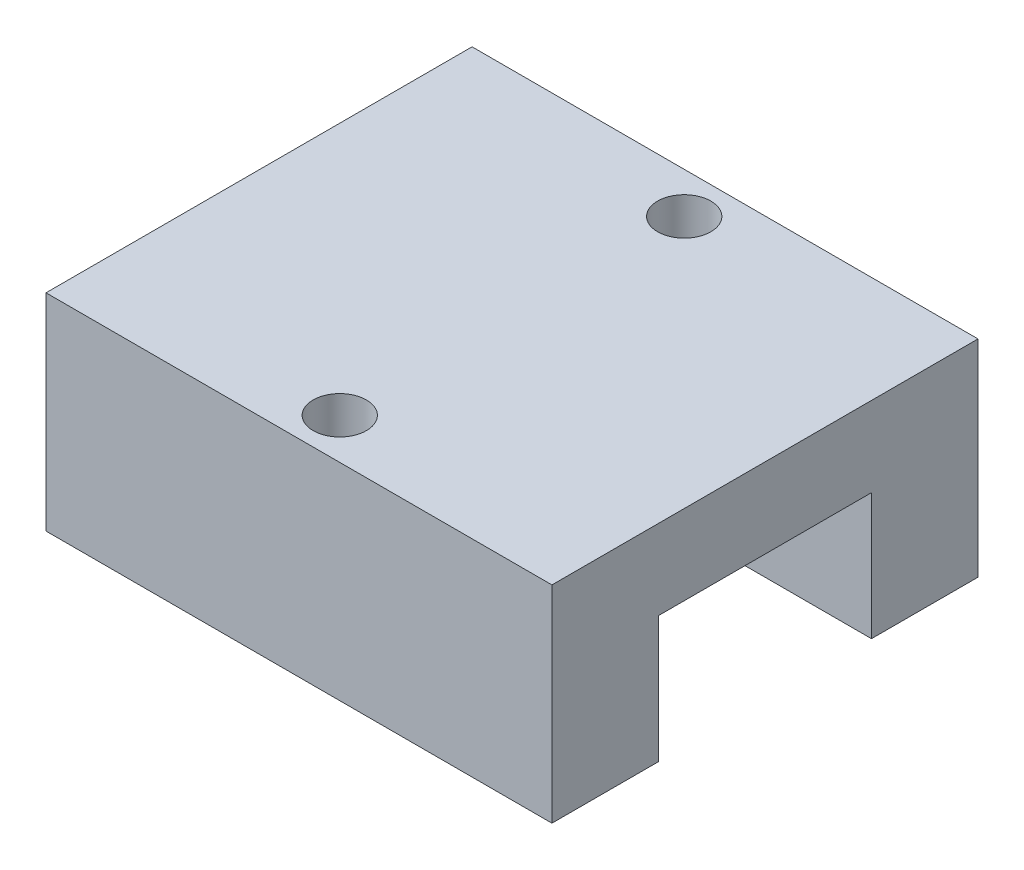
ISO-10303-21;
HEADER;
FILE_DESCRIPTION(('STEP AP214'),'2;1');
FILE_NAME('part.step','',(''),(''),'','','');
FILE_SCHEMA(('AUTOMOTIVE_DESIGN { 1 0 10303 214 1 1 1 1 }'));
ENDSEC;
DATA;
#1=APPLICATION_CONTEXT('core data for automotive mechanical design processes');
#2=APPLICATION_PROTOCOL_DEFINITION('international standard','automotive_design',2000,#1);
#3=PRODUCT_CONTEXT('',#1,'mechanical');
#4=PRODUCT('Part','Part','',(#3));
#5=PRODUCT_RELATED_PRODUCT_CATEGORY('part','',(#4));
#6=PRODUCT_DEFINITION_FORMATION('','',#4);
#7=PRODUCT_DEFINITION_CONTEXT('part definition',#1,'design');
#8=PRODUCT_DEFINITION('design','',#6,#7);
#9=PRODUCT_DEFINITION_SHAPE('','',#8);
#10=(LENGTH_UNIT() NAMED_UNIT(*) SI_UNIT(.MILLI.,.METRE.));
#11=(NAMED_UNIT(*) PLANE_ANGLE_UNIT() SI_UNIT($,.RADIAN.));
#12=(NAMED_UNIT(*) SI_UNIT($,.STERADIAN.) SOLID_ANGLE_UNIT());
#13=UNCERTAINTY_MEASURE_WITH_UNIT(LENGTH_MEASURE(1.E-05),#10,'distance_accuracy_value','');
#14=(GEOMETRIC_REPRESENTATION_CONTEXT(3) GLOBAL_UNCERTAINTY_ASSIGNED_CONTEXT((#13)) GLOBAL_UNIT_ASSIGNED_CONTEXT((#10,
#11,#12)) REPRESENTATION_CONTEXT('',''));
#15=CARTESIAN_POINT('',(0.,0.,0.));
#16=DIRECTION('',(0.,0.,1.));
#17=DIRECTION('',(1.,0.,0.));
#18=AXIS2_PLACEMENT_3D('',#15,#16,#17);
#19=CARTESIAN_POINT('',(-9.5,0.,8.));
#20=DIRECTION('',(0.,1.,0.));
#21=DIRECTION('',(0.,0.,1.));
#22=AXIS2_PLACEMENT_3D('',#19,#20,#21);
#23=PLANE('',#22);
#24=CARTESIAN_POINT('',(0.,0.,6.4675));
#25=DIRECTION('',(0.,-1.,0.));
#26=DIRECTION('',(0.,0.,-1.));
#27=AXIS2_PLACEMENT_3D('',#24,#25,#26);
#28=CIRCLE('',#27,1.);
#29=CARTESIAN_POINT('',(0.,0.,5.4675));
#30=VERTEX_POINT('',#29);
#31=EDGE_CURVE('E167',#30,#30,#28,.T.);
#32=ORIENTED_EDGE('',*,*,#31,.F.);
#33=EDGE_LOOP('',(#32));
#34=FACE_BOUND('',#33,.T.);
#35=DIRECTION('',(0.,0.,1.));
#36=VECTOR('',#35,1.);
#37=CARTESIAN_POINT('',(-9.49999999999999,0.,-8.));
#38=LINE('',#37,#36);
#39=CARTESIAN_POINT('',(-9.5,0.,4.));
#40=VERTEX_POINT('',#39);
#41=CARTESIAN_POINT('',(-9.5,0.,8.));
#42=VERTEX_POINT('',#41);
#43=EDGE_CURVE('E122',#40,#42,#38,.T.);
#44=ORIENTED_EDGE('',*,*,#43,.F.);
#45=DIRECTION('',(1.,0.,0.));
#46=VECTOR('',#45,1.);
#47=CARTESIAN_POINT('',(-9.5,0.,4.));
#48=LINE('',#47,#46);
#49=CARTESIAN_POINT('',(9.50000000000001,0.,4.));
#50=VERTEX_POINT('',#49);
#51=EDGE_CURVE('E11',#40,#50,#48,.T.);
#52=ORIENTED_EDGE('',*,*,#51,.T.);
#53=DIRECTION('',(0.,0.,-1.));
#54=VECTOR('',#53,1.);
#55=CARTESIAN_POINT('',(9.50000000000001,0.,-8.));
#56=LINE('',#55,#54);
#57=CARTESIAN_POINT('',(9.50000000000001,0.,8.));
#58=VERTEX_POINT('',#57);
#59=EDGE_CURVE('E121',#58,#50,#56,.T.);
#60=ORIENTED_EDGE('',*,*,#59,.F.);
#61=DIRECTION('',(1.,0.,0.));
#62=VECTOR('',#61,1.);
#63=CARTESIAN_POINT('',(-9.5,0.,8.));
#64=LINE('',#63,#62);
#65=EDGE_CURVE('E131',#42,#58,#64,.T.);
#66=ORIENTED_EDGE('',*,*,#65,.F.);
#67=EDGE_LOOP('',(#44,#52,#60,#66));
#68=FACE_BOUND('',#67,.T.);
#69=ADVANCED_FACE('F31',(#34,#68),#23,.F.);
#70=CARTESIAN_POINT('',(-9.49999999999999,7.75,-8.));
#71=DIRECTION('',(1.,0.,0.));
#72=DIRECTION('',(0.,0.,-1.));
#73=AXIS2_PLACEMENT_3D('',#70,#71,#72);
#74=PLANE('',#73);
#75=DIRECTION('',(0.,0.,1.));
#76=VECTOR('',#75,1.);
#77=CARTESIAN_POINT('',(-9.49999999999999,4.75,-8.));
#78=LINE('',#77,#76);
#79=CARTESIAN_POINT('',(-9.5,4.75,-4.));
#80=VERTEX_POINT('',#79);
#81=CARTESIAN_POINT('',(-9.5,4.75,4.));
#82=VERTEX_POINT('',#81);
#83=EDGE_CURVE('E170',#80,#82,#78,.T.);
#84=ORIENTED_EDGE('',*,*,#83,.T.);
#85=DIRECTION('',(0.,-1.,0.));
#86=VECTOR('',#85,1.);
#87=CARTESIAN_POINT('',(-9.5,7.75,4.));
#88=LINE('',#87,#86);
#89=EDGE_CURVE('E172',#82,#40,#88,.T.);
#90=ORIENTED_EDGE('',*,*,#89,.T.);
#91=ORIENTED_EDGE('',*,*,#43,.T.);
#92=DIRECTION('',(0.,-1.,0.));
#93=VECTOR('',#92,1.);
#94=CARTESIAN_POINT('',(-9.5,7.75,8.));
#95=LINE('',#94,#93);
#96=CARTESIAN_POINT('',(-9.5,7.75,8.));
#97=VERTEX_POINT('',#96);
#98=EDGE_CURVE('E140',#97,#42,#95,.T.);
#99=ORIENTED_EDGE('',*,*,#98,.F.);
#100=DIRECTION('',(0.,0.,1.));
#101=VECTOR('',#100,1.);
#102=CARTESIAN_POINT('',(-9.49999999999999,7.75,-8.));
#103=LINE('',#102,#101);
#104=CARTESIAN_POINT('',(-9.49999999999999,7.75,-8.));
#105=VERTEX_POINT('',#104);
#106=EDGE_CURVE('E129',#105,#97,#103,.T.);
#107=ORIENTED_EDGE('',*,*,#106,.F.);
#108=DIRECTION('',(0.,-1.,0.));
#109=VECTOR('',#108,1.);
#110=CARTESIAN_POINT('',(-9.49999999999999,7.75,-8.));
#111=LINE('',#110,#109);
#112=CARTESIAN_POINT('',(-9.49999999999999,0.,-8.));
#113=VERTEX_POINT('',#112);
#114=EDGE_CURVE('E135',#105,#113,#111,.T.);
#115=ORIENTED_EDGE('',*,*,#114,.T.);
#116=CARTESIAN_POINT('',(-9.5,0.,-4.));
#117=VERTEX_POINT('',#116);
#118=EDGE_CURVE('E146',#113,#117,#38,.T.);
#119=ORIENTED_EDGE('',*,*,#118,.T.);
#120=DIRECTION('',(0.,1.,0.));
#121=VECTOR('',#120,1.);
#122=CARTESIAN_POINT('',(-9.5,7.75,-4.));
#123=LINE('',#122,#121);
#124=EDGE_CURVE('E46',#117,#80,#123,.T.);
#125=ORIENTED_EDGE('',*,*,#124,.T.);
#126=EDGE_LOOP('',(#84,#90,#91,#99,#107,#115,#119,#125));
#127=FACE_BOUND('',#126,.T.);
#128=ADVANCED_FACE('F33',(#127),#74,.F.);
#129=CARTESIAN_POINT('',(-9.5,7.75,8.));
#130=DIRECTION('',(0.,0.,-1.));
#131=DIRECTION('',(-1.,0.,0.));
#132=AXIS2_PLACEMENT_3D('',#129,#130,#131);
#133=PLANE('',#132);
#134=ORIENTED_EDGE('',*,*,#65,.T.);
#135=DIRECTION('',(0.,-1.,0.));
#136=VECTOR('',#135,1.);
#137=CARTESIAN_POINT('',(9.50000000000001,7.75,8.));
#138=LINE('',#137,#136);
#139=CARTESIAN_POINT('',(9.50000000000001,7.75,8.));
#140=VERTEX_POINT('',#139);
#141=EDGE_CURVE('E126',#140,#58,#138,.T.);
#142=ORIENTED_EDGE('',*,*,#141,.F.);
#143=DIRECTION('',(1.,0.,0.));
#144=VECTOR('',#143,1.);
#145=CARTESIAN_POINT('',(-9.5,7.75,8.));
#146=LINE('',#145,#144);
#147=EDGE_CURVE('E84',#97,#140,#146,.T.);
#148=ORIENTED_EDGE('',*,*,#147,.F.);
#149=ORIENTED_EDGE('',*,*,#98,.T.);
#150=EDGE_LOOP('',(#134,#142,#148,#149));
#151=FACE_BOUND('',#150,.T.);
#152=ADVANCED_FACE('F184',(#151),#133,.F.);
#153=CARTESIAN_POINT('',(9.50000000000001,7.75,-8.));
#154=DIRECTION('',(-1.,0.,0.));
#155=DIRECTION('',(0.,0.,1.));
#156=AXIS2_PLACEMENT_3D('',#153,#154,#155);
#157=PLANE('',#156);
#158=ORIENTED_EDGE('',*,*,#59,.T.);
#159=DIRECTION('',(0.,-1.,0.));
#160=VECTOR('',#159,1.);
#161=CARTESIAN_POINT('',(9.50000000000001,0.,4.));
#162=LINE('',#161,#160);
#163=CARTESIAN_POINT('',(9.50000000000001,4.75,4.));
#164=VERTEX_POINT('',#163);
#165=EDGE_CURVE('E106',#164,#50,#162,.T.);
#166=ORIENTED_EDGE('',*,*,#165,.F.);
#167=DIRECTION('',(0.,0.,1.));
#168=VECTOR('',#167,1.);
#169=CARTESIAN_POINT('',(9.50000000000001,4.75,4.));
#170=LINE('',#169,#168);
#171=CARTESIAN_POINT('',(9.50000000000001,4.75,-4.));
#172=VERTEX_POINT('',#171);
#173=EDGE_CURVE('E177',#172,#164,#170,.T.);
#174=ORIENTED_EDGE('',*,*,#173,.F.);
#175=DIRECTION('',(0.,1.,0.));
#176=VECTOR('',#175,1.);
#177=CARTESIAN_POINT('',(9.50000000000001,0.,-4.));
#178=LINE('',#177,#176);
#179=CARTESIAN_POINT('',(9.50000000000001,0.,-4.));
#180=VERTEX_POINT('',#179);
#181=EDGE_CURVE('E115',#180,#172,#178,.T.);
#182=ORIENTED_EDGE('',*,*,#181,.F.);
#183=CARTESIAN_POINT('',(9.50000000000001,0.,-8.));
#184=VERTEX_POINT('',#183);
#185=EDGE_CURVE('E127',#180,#184,#56,.T.);
#186=ORIENTED_EDGE('',*,*,#185,.T.);
#187=DIRECTION('',(0.,-1.,0.));
#188=VECTOR('',#187,1.);
#189=CARTESIAN_POINT('',(9.50000000000001,7.75,-8.));
#190=LINE('',#189,#188);
#191=CARTESIAN_POINT('',(9.50000000000001,7.75,-8.));
#192=VERTEX_POINT('',#191);
#193=EDGE_CURVE('E137',#192,#184,#190,.T.);
#194=ORIENTED_EDGE('',*,*,#193,.F.);
#195=DIRECTION('',(0.,0.,-1.));
#196=VECTOR('',#195,1.);
#197=CARTESIAN_POINT('',(9.50000000000001,7.75,-8.));
#198=LINE('',#197,#196);
#199=EDGE_CURVE('E155',#140,#192,#198,.T.);
#200=ORIENTED_EDGE('',*,*,#199,.F.);
#201=ORIENTED_EDGE('',*,*,#141,.T.);
#202=EDGE_LOOP('',(#158,#166,#174,#182,#186,#194,#200,#201));
#203=FACE_BOUND('',#202,.T.);
#204=ADVANCED_FACE('F124',(#203),#157,.F.);
#205=CARTESIAN_POINT('',(-9.49999999999999,7.75,-8.));
#206=DIRECTION('',(0.,0.,1.));
#207=DIRECTION('',(1.,0.,0.));
#208=AXIS2_PLACEMENT_3D('',#205,#206,#207);
#209=PLANE('',#208);
#210=DIRECTION('',(-1.,0.,0.));
#211=VECTOR('',#210,1.);
#212=CARTESIAN_POINT('',(-9.49999999999999,0.,-8.));
#213=LINE('',#212,#211);
#214=EDGE_CURVE('E76',#184,#113,#213,.T.);
#215=ORIENTED_EDGE('',*,*,#214,.T.);
#216=ORIENTED_EDGE('',*,*,#114,.F.);
#217=DIRECTION('',(-1.,0.,0.));
#218=VECTOR('',#217,1.);
#219=CARTESIAN_POINT('',(-9.49999999999999,7.75,-8.));
#220=LINE('',#219,#218);
#221=EDGE_CURVE('E55',#192,#105,#220,.T.);
#222=ORIENTED_EDGE('',*,*,#221,.F.);
#223=ORIENTED_EDGE('',*,*,#193,.T.);
#224=EDGE_LOOP('',(#215,#216,#222,#223));
#225=FACE_BOUND('',#224,.T.);
#226=ADVANCED_FACE('F190',(#225),#209,.F.);
#227=CARTESIAN_POINT('',(-9.5,7.75,8.));
#228=DIRECTION('',(0.,1.,0.));
#229=DIRECTION('',(0.,0.,1.));
#230=AXIS2_PLACEMENT_3D('',#227,#228,#229);
#231=PLANE('',#230);
#232=CARTESIAN_POINT('',(0.,7.75,6.4675));
#233=DIRECTION('',(0.,1.,0.));
#234=DIRECTION('',(0.,0.,1.));
#235=AXIS2_PLACEMENT_3D('',#232,#233,#234);
#236=CIRCLE('',#235,1.);
#237=CARTESIAN_POINT('',(0.,7.75,7.4675));
#238=VERTEX_POINT('',#237);
#239=EDGE_CURVE('E164',#238,#238,#236,.T.);
#240=ORIENTED_EDGE('',*,*,#239,.F.);
#241=EDGE_LOOP('',(#240));
#242=FACE_BOUND('',#241,.T.);
#243=CARTESIAN_POINT('',(0.,7.75,-6.4675));
#244=DIRECTION('',(0.,1.,0.));
#245=DIRECTION('',(0.,0.,1.));
#246=AXIS2_PLACEMENT_3D('',#243,#244,#245);
#247=CIRCLE('',#246,1.);
#248=CARTESIAN_POINT('',(0.,7.75,-5.4675));
#249=VERTEX_POINT('',#248);
#250=EDGE_CURVE('E152',#249,#249,#247,.T.);
#251=ORIENTED_EDGE('',*,*,#250,.F.);
#252=EDGE_LOOP('',(#251));
#253=FACE_BOUND('',#252,.T.);
#254=ORIENTED_EDGE('',*,*,#106,.T.);
#255=ORIENTED_EDGE('',*,*,#147,.T.);
#256=ORIENTED_EDGE('',*,*,#199,.T.);
#257=ORIENTED_EDGE('',*,*,#221,.T.);
#258=EDGE_LOOP('',(#254,#255,#256,#257));
#259=FACE_BOUND('',#258,.T.);
#260=ADVANCED_FACE('F202',(#242,#253,#259),#231,.T.);
#261=CARTESIAN_POINT('',(0.,0.,-6.4675));
#262=DIRECTION('',(0.,-1.,0.));
#263=DIRECTION('',(0.,0.,-1.));
#264=AXIS2_PLACEMENT_3D('',#261,#262,#263);
#265=CIRCLE('',#264,1.);
#266=CARTESIAN_POINT('',(0.,0.,-7.4675));
#267=VERTEX_POINT('',#266);
#268=EDGE_CURVE('E161',#267,#267,#265,.T.);
#269=ORIENTED_EDGE('',*,*,#268,.F.);
#270=EDGE_LOOP('',(#269));
#271=FACE_BOUND('',#270,.T.);
#272=ORIENTED_EDGE('',*,*,#185,.F.);
#273=DIRECTION('',(-1.,0.,0.));
#274=VECTOR('',#273,1.);
#275=CARTESIAN_POINT('',(-9.5,0.,-4.));
#276=LINE('',#275,#274);
#277=EDGE_CURVE('E39',#180,#117,#276,.T.);
#278=ORIENTED_EDGE('',*,*,#277,.T.);
#279=ORIENTED_EDGE('',*,*,#118,.F.);
#280=ORIENTED_EDGE('',*,*,#214,.F.);
#281=EDGE_LOOP('',(#272,#278,#279,#280));
#282=FACE_BOUND('',#281,.T.);
#283=ADVANCED_FACE('F145',(#271,#282),#23,.F.);
#284=CARTESIAN_POINT('',(0.,17.75,-6.4675));
#285=DIRECTION('',(0.,-1.,0.));
#286=DIRECTION('',(0.,0.,-1.));
#287=AXIS2_PLACEMENT_3D('',#284,#285,#286);
#288=CYLINDRICAL_SURFACE('',#287,1.);
#289=ORIENTED_EDGE('',*,*,#250,.T.);
#290=EDGE_LOOP('',(#289));
#291=FACE_BOUND('',#290,.T.);
#292=ORIENTED_EDGE('',*,*,#268,.T.);
#293=EDGE_LOOP('',(#292));
#294=FACE_BOUND('',#293,.T.);
#295=ADVANCED_FACE('F201',(#291,#294),#288,.F.);
#296=CARTESIAN_POINT('',(0.,17.75,6.4675));
#297=DIRECTION('',(0.,-1.,0.));
#298=DIRECTION('',(0.,0.,-1.));
#299=AXIS2_PLACEMENT_3D('',#296,#297,#298);
#300=CYLINDRICAL_SURFACE('',#299,1.);
#301=ORIENTED_EDGE('',*,*,#239,.T.);
#302=EDGE_LOOP('',(#301));
#303=FACE_BOUND('',#302,.T.);
#304=ORIENTED_EDGE('',*,*,#31,.T.);
#305=EDGE_LOOP('',(#304));
#306=FACE_BOUND('',#305,.T.);
#307=ADVANCED_FACE('F208',(#303,#306),#300,.F.);
#308=CARTESIAN_POINT('',(-18.25,4.75,4.));
#309=DIRECTION('',(0.,1.,0.));
#310=DIRECTION('',(0.,0.,1.));
#311=AXIS2_PLACEMENT_3D('',#308,#309,#310);
#312=PLANE('',#311);
#313=DIRECTION('',(1.,0.,0.));
#314=VECTOR('',#313,1.);
#315=CARTESIAN_POINT('',(-18.25,4.75,-4.));
#316=LINE('',#315,#314);
#317=EDGE_CURVE('E175',#80,#172,#316,.T.);
#318=ORIENTED_EDGE('',*,*,#317,.T.);
#319=ORIENTED_EDGE('',*,*,#173,.T.);
#320=DIRECTION('',(1.,0.,0.));
#321=VECTOR('',#320,1.);
#322=CARTESIAN_POINT('',(-18.25,4.75,4.));
#323=LINE('',#322,#321);
#324=EDGE_CURVE('E110',#82,#164,#323,.T.);
#325=ORIENTED_EDGE('',*,*,#324,.F.);
#326=ORIENTED_EDGE('',*,*,#83,.F.);
#327=EDGE_LOOP('',(#318,#319,#325,#326));
#328=FACE_BOUND('',#327,.T.);
#329=ADVANCED_FACE('F182',(#328),#312,.F.);
#330=CARTESIAN_POINT('',(-18.25,0.,4.));
#331=DIRECTION('',(0.,0.,1.));
#332=DIRECTION('',(1.,0.,0.));
#333=AXIS2_PLACEMENT_3D('',#330,#331,#332);
#334=PLANE('',#333);
#335=ORIENTED_EDGE('',*,*,#324,.T.);
#336=ORIENTED_EDGE('',*,*,#165,.T.);
#337=ORIENTED_EDGE('',*,*,#51,.F.);
#338=ORIENTED_EDGE('',*,*,#89,.F.);
#339=EDGE_LOOP('',(#335,#336,#337,#338));
#340=FACE_BOUND('',#339,.T.);
#341=ADVANCED_FACE('F107',(#340),#334,.F.);
#342=CARTESIAN_POINT('',(-18.25,0.,-4.));
#343=DIRECTION('',(0.,0.,-1.));
#344=DIRECTION('',(-1.,0.,0.));
#345=AXIS2_PLACEMENT_3D('',#342,#343,#344);
#346=PLANE('',#345);
#347=ORIENTED_EDGE('',*,*,#277,.F.);
#348=ORIENTED_EDGE('',*,*,#181,.T.);
#349=ORIENTED_EDGE('',*,*,#317,.F.);
#350=ORIENTED_EDGE('',*,*,#124,.F.);
#351=EDGE_LOOP('',(#347,#348,#349,#350));
#352=FACE_BOUND('',#351,.T.);
#353=ADVANCED_FACE('F180',(#352),#346,.F.);
#354=CLOSED_SHELL('',(#69,#128,#152,#204,#226,#260,#283,#295,#307,#329,#341,#353));
#355=MANIFOLD_SOLID_BREP('B2',#354);
#356=ADVANCED_BREP_SHAPE_REPRESENTATION('',(#18,#355),#14);
#357=SHAPE_DEFINITION_REPRESENTATION(#9,#356);
ENDSEC;
END-ISO-10303-21;
